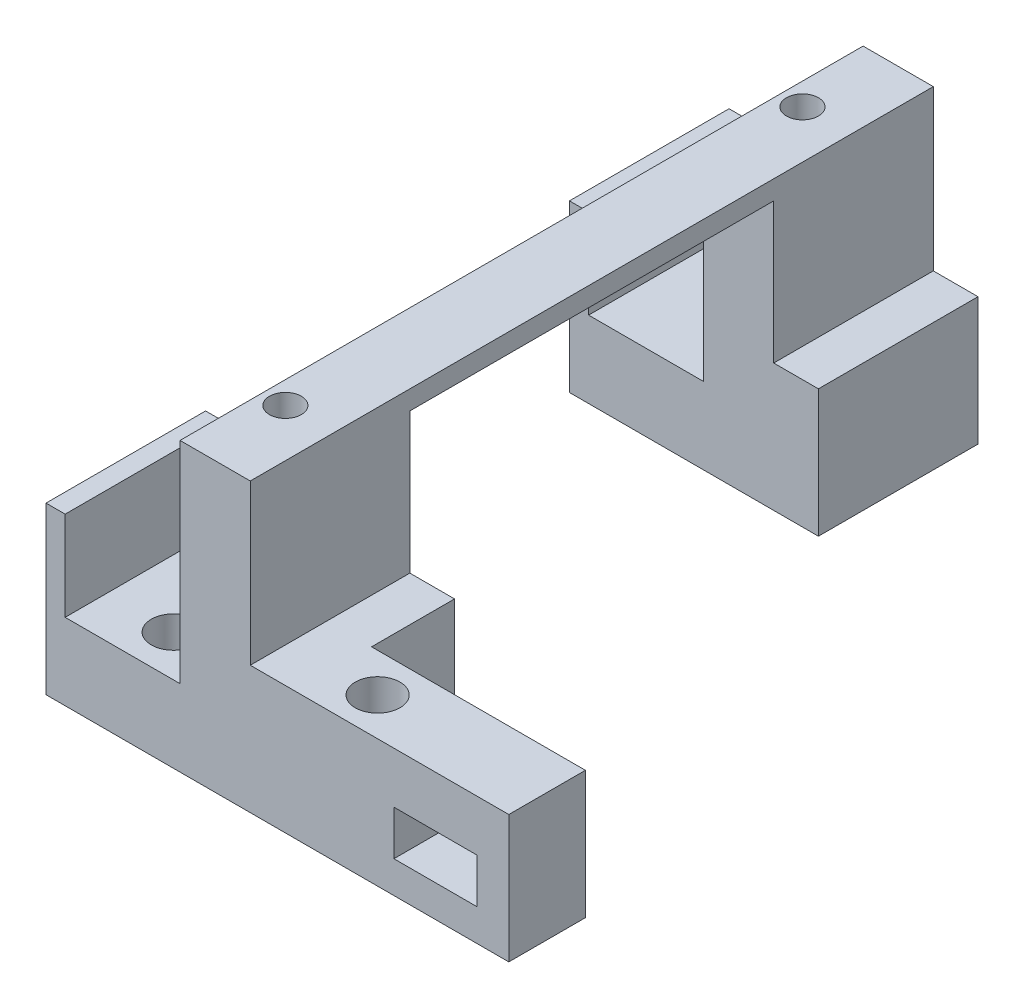
ISO-10303-21;
HEADER;
FILE_DESCRIPTION(('STEP AP214'),'2;1');
FILE_NAME('part.step','',(''),(''),'','','');
FILE_SCHEMA(('AUTOMOTIVE_DESIGN { 1 0 10303 214 1 1 1 1 }'));
ENDSEC;
DATA;
#1=APPLICATION_CONTEXT('core data for automotive mechanical design processes');
#2=APPLICATION_PROTOCOL_DEFINITION('international standard','automotive_design',2000,#1);
#3=PRODUCT_CONTEXT('',#1,'mechanical');
#4=PRODUCT('Part','Part','',(#3));
#5=PRODUCT_RELATED_PRODUCT_CATEGORY('part','',(#4));
#6=PRODUCT_DEFINITION_FORMATION('','',#4);
#7=PRODUCT_DEFINITION_CONTEXT('part definition',#1,'design');
#8=PRODUCT_DEFINITION('design','',#6,#7);
#9=PRODUCT_DEFINITION_SHAPE('','',#8);
#10=(LENGTH_UNIT() NAMED_UNIT(*) SI_UNIT(.MILLI.,.METRE.));
#11=(NAMED_UNIT(*) PLANE_ANGLE_UNIT() SI_UNIT($,.RADIAN.));
#12=(NAMED_UNIT(*) SI_UNIT($,.STERADIAN.) SOLID_ANGLE_UNIT());
#13=UNCERTAINTY_MEASURE_WITH_UNIT(LENGTH_MEASURE(1.E-05),#10,'distance_accuracy_value','');
#14=(GEOMETRIC_REPRESENTATION_CONTEXT(3) GLOBAL_UNCERTAINTY_ASSIGNED_CONTEXT((#13)) GLOBAL_UNIT_ASSIGNED_CONTEXT((#10,
#11,#12)) REPRESENTATION_CONTEXT('',''));
#15=CARTESIAN_POINT('',(0.,0.,0.));
#16=DIRECTION('',(0.,0.,1.));
#17=DIRECTION('',(1.,0.,0.));
#18=AXIS2_PLACEMENT_3D('',#15,#16,#17);
#19=CARTESIAN_POINT('',(39.,0.,107.));
#20=DIRECTION('',(-1.,0.,0.));
#21=DIRECTION('',(0.,0.,1.));
#22=AXIS2_PLACEMENT_3D('',#19,#20,#21);
#23=PLANE('',#22);
#24=DIRECTION('',(0.,1.,0.));
#25=VECTOR('',#24,1.);
#26=CARTESIAN_POINT('',(39.,0.,95.));
#27=LINE('',#26,#25);
#28=CARTESIAN_POINT('',(39.,0.,95.));
#29=VERTEX_POINT('',#28);
#30=CARTESIAN_POINT('',(39.,20.,95.));
#31=VERTEX_POINT('',#30);
#32=EDGE_CURVE('E250',#29,#31,#27,.T.);
#33=ORIENTED_EDGE('',*,*,#32,.F.);
#34=DIRECTION('',(0.,0.,-1.));
#35=VECTOR('',#34,1.);
#36=CARTESIAN_POINT('',(39.,0.,107.));
#37=LINE('',#36,#35);
#38=CARTESIAN_POINT('',(39.,0.,82.));
#39=VERTEX_POINT('',#38);
#40=EDGE_CURVE('E437',#29,#39,#37,.T.);
#41=ORIENTED_EDGE('',*,*,#40,.T.);
#42=DIRECTION('',(0.,-1.,0.));
#43=VECTOR('',#42,1.);
#44=CARTESIAN_POINT('',(39.,42.,82.));
#45=LINE('',#44,#43);
#46=CARTESIAN_POINT('',(39.,20.,82.));
#47=VERTEX_POINT('',#46);
#48=EDGE_CURVE('E309',#47,#39,#45,.T.);
#49=ORIENTED_EDGE('',*,*,#48,.F.);
#50=DIRECTION('',(0.,0.,-1.));
#51=VECTOR('',#50,1.);
#52=CARTESIAN_POINT('',(39.,20.,107.));
#53=LINE('',#52,#51);
#54=EDGE_CURVE('E270',#31,#47,#53,.T.);
#55=ORIENTED_EDGE('',*,*,#54,.F.);
#56=EDGE_LOOP('',(#33,#41,#49,#55));
#57=FACE_BOUND('',#56,.T.);
#58=ADVANCED_FACE('F33',(#57),#23,.F.);
#59=CARTESIAN_POINT('',(0.,26.,107.));
#60=DIRECTION('',(1.,0.,0.));
#61=DIRECTION('',(0.,1.,0.));
#62=AXIS2_PLACEMENT_3D('',#59,#60,#61);
#63=PLANE('',#62);
#64=DIRECTION('',(0.,0.,-1.));
#65=VECTOR('',#64,1.);
#66=CARTESIAN_POINT('',(0.,0.,107.));
#67=LINE('',#66,#65);
#68=CARTESIAN_POINT('',(0.,0.,25.));
#69=VERTEX_POINT('',#68);
#70=CARTESIAN_POINT('',(0.,0.,0.));
#71=VERTEX_POINT('',#70);
#72=EDGE_CURVE('E440',#69,#71,#67,.T.);
#73=ORIENTED_EDGE('',*,*,#72,.F.);
#74=DIRECTION('',(0.,-1.,0.));
#75=VECTOR('',#74,1.);
#76=CARTESIAN_POINT('',(0.,0.,25.));
#77=LINE('',#76,#75);
#78=CARTESIAN_POINT('',(0.,26.,25.));
#79=VERTEX_POINT('',#78);
#80=EDGE_CURVE('E312',#79,#69,#77,.T.);
#81=ORIENTED_EDGE('',*,*,#80,.F.);
#82=DIRECTION('',(0.,0.,-1.));
#83=VECTOR('',#82,1.);
#84=CARTESIAN_POINT('',(0.,26.,107.));
#85=LINE('',#84,#83);
#86=CARTESIAN_POINT('',(0.,26.,0.));
#87=VERTEX_POINT('',#86);
#88=EDGE_CURVE('E380',#79,#87,#85,.T.);
#89=ORIENTED_EDGE('',*,*,#88,.T.);
#90=DIRECTION('',(0.,-1.,0.));
#91=VECTOR('',#90,1.);
#92=CARTESIAN_POINT('',(0.,26.,0.));
#93=LINE('',#92,#91);
#94=EDGE_CURVE('E359',#87,#71,#93,.T.);
#95=ORIENTED_EDGE('',*,*,#94,.T.);
#96=EDGE_LOOP('',(#73,#81,#89,#95));
#97=FACE_BOUND('',#96,.T.);
#98=ADVANCED_FACE('F464',(#97),#63,.F.);
#99=CARTESIAN_POINT('',(0.,0.,107.));
#100=DIRECTION('',(0.,1.,0.));
#101=DIRECTION('',(0.,0.,1.));
#102=AXIS2_PLACEMENT_3D('',#99,#100,#101);
#103=PLANE('',#102);
#104=CARTESIAN_POINT('',(13.5,0.,6.5));
#105=DIRECTION('',(0.,1.,0.));
#106=DIRECTION('',(0.,0.,1.));
#107=AXIS2_PLACEMENT_3D('',#104,#105,#106);
#108=CIRCLE('',#107,3.5);
#109=CARTESIAN_POINT('',(13.5,0.,10.));
#110=VERTEX_POINT('',#109);
#111=EDGE_CURVE('E281',#110,#110,#108,.F.);
#112=ORIENTED_EDGE('',*,*,#111,.F.);
#113=EDGE_LOOP('',(#112));
#114=FACE_BOUND('',#113,.T.);
#115=CARTESIAN_POINT('',(24.5,0.,13.));
#116=DIRECTION('',(0.,1.,0.));
#117=DIRECTION('',(0.,0.,1.));
#118=AXIS2_PLACEMENT_3D('',#115,#116,#117);
#119=CIRCLE('',#118,2.5);
#120=CARTESIAN_POINT('',(24.5,0.,15.5));
#121=VERTEX_POINT('',#120);
#122=EDGE_CURVE('E297',#121,#121,#119,.F.);
#123=ORIENTED_EDGE('',*,*,#122,.F.);
#124=EDGE_LOOP('',(#123));
#125=FACE_BOUND('',#124,.T.);
#126=CARTESIAN_POINT('',(39.,0.,25.));
#127=VERTEX_POINT('',#126);
#128=CARTESIAN_POINT('',(39.,0.,0.));
#129=VERTEX_POINT('',#128);
#130=EDGE_CURVE('E434',#127,#129,#37,.T.);
#131=ORIENTED_EDGE('',*,*,#130,.F.);
#132=DIRECTION('',(-1.,0.,0.));
#133=VECTOR('',#132,1.);
#134=CARTESIAN_POINT('',(109.802542327236,0.,25.));
#135=LINE('',#134,#133);
#136=EDGE_CURVE('E310',#127,#69,#135,.T.);
#137=ORIENTED_EDGE('',*,*,#136,.T.);
#138=ORIENTED_EDGE('',*,*,#72,.T.);
#139=DIRECTION('',(1.,0.,0.));
#140=VECTOR('',#139,1.);
#141=CARTESIAN_POINT('',(0.,0.,0.));
#142=LINE('',#141,#140);
#143=EDGE_CURVE('E383',#71,#129,#142,.T.);
#144=ORIENTED_EDGE('',*,*,#143,.T.);
#145=EDGE_LOOP('',(#131,#137,#138,#144));
#146=FACE_BOUND('',#145,.T.);
#147=ADVANCED_FACE('F455',(#114,#125,#146),#103,.F.);
#148=CARTESIAN_POINT('',(39.,20.,25.));
#149=VERTEX_POINT('',#148);
#150=CARTESIAN_POINT('',(39.,20.,0.));
#151=VERTEX_POINT('',#150);
#152=EDGE_CURVE('E431',#149,#151,#53,.T.);
#153=ORIENTED_EDGE('',*,*,#152,.F.);
#154=DIRECTION('',(0.,1.,0.));
#155=VECTOR('',#154,1.);
#156=CARTESIAN_POINT('',(39.,0.,25.));
#157=LINE('',#156,#155);
#158=EDGE_CURVE('E307',#127,#149,#157,.T.);
#159=ORIENTED_EDGE('',*,*,#158,.F.);
#160=ORIENTED_EDGE('',*,*,#130,.T.);
#161=DIRECTION('',(0.,1.,0.));
#162=VECTOR('',#161,1.);
#163=CARTESIAN_POINT('',(39.,0.,0.));
#164=LINE('',#163,#162);
#165=EDGE_CURVE('E386',#129,#151,#164,.T.);
#166=ORIENTED_EDGE('',*,*,#165,.T.);
#167=EDGE_LOOP('',(#153,#159,#160,#166));
#168=FACE_BOUND('',#167,.T.);
#169=ADVANCED_FACE('F497',(#168),#23,.F.);
#170=CARTESIAN_POINT('',(39.,20.,107.));
#171=DIRECTION('',(0.,-1.,0.));
#172=DIRECTION('',(0.,0.,-1.));
#173=AXIS2_PLACEMENT_3D('',#170,#171,#172);
#174=PLANE('',#173);
#175=DIRECTION('',(0.,0.,-1.));
#176=VECTOR('',#175,1.);
#177=CARTESIAN_POINT('',(32.,20.,107.));
#178=LINE('',#177,#176);
#179=CARTESIAN_POINT('',(32.,20.,25.));
#180=VERTEX_POINT('',#179);
#181=CARTESIAN_POINT('',(32.,20.,0.));
#182=VERTEX_POINT('',#181);
#183=EDGE_CURVE('E428',#180,#182,#178,.T.);
#184=ORIENTED_EDGE('',*,*,#183,.F.);
#185=DIRECTION('',(1.,0.,0.));
#186=VECTOR('',#185,1.);
#187=CARTESIAN_POINT('',(39.,20.,25.));
#188=LINE('',#187,#186);
#189=EDGE_CURVE('E353',#180,#149,#188,.T.);
#190=ORIENTED_EDGE('',*,*,#189,.T.);
#191=ORIENTED_EDGE('',*,*,#152,.T.);
#192=DIRECTION('',(-1.,0.,0.));
#193=VECTOR('',#192,1.);
#194=CARTESIAN_POINT('',(39.,20.,0.));
#195=LINE('',#194,#193);
#196=EDGE_CURVE('E389',#151,#182,#195,.T.);
#197=ORIENTED_EDGE('',*,*,#196,.T.);
#198=EDGE_LOOP('',(#184,#190,#191,#197));
#199=FACE_BOUND('',#198,.T.);
#200=ADVANCED_FACE('F493',(#199),#174,.F.);
#201=CARTESIAN_POINT('',(21.,12.,107.));
#202=DIRECTION('',(0.,-1.,0.));
#203=DIRECTION('',(1.,0.,0.));
#204=AXIS2_PLACEMENT_3D('',#201,#202,#203);
#205=PLANE('',#204);
#206=CARTESIAN_POINT('',(13.5,12.,6.5));
#207=DIRECTION('',(0.,1.,0.));
#208=DIRECTION('',(-1.,0.,0.));
#209=AXIS2_PLACEMENT_3D('',#206,#207,#208);
#210=CIRCLE('',#209,3.5);
#211=CARTESIAN_POINT('',(9.99999999999999,12.,6.5));
#212=VERTEX_POINT('',#211);
#213=EDGE_CURVE('E264',#212,#212,#210,.T.);
#214=ORIENTED_EDGE('',*,*,#213,.F.);
#215=EDGE_LOOP('',(#214));
#216=FACE_BOUND('',#215,.T.);
#217=DIRECTION('',(0.,0.,-1.));
#218=VECTOR('',#217,1.);
#219=CARTESIAN_POINT('',(3.,12.,107.));
#220=LINE('',#219,#218);
#221=CARTESIAN_POINT('',(3.,12.,25.));
#222=VERTEX_POINT('',#221);
#223=CARTESIAN_POINT('',(3.,12.,0.));
#224=VERTEX_POINT('',#223);
#225=EDGE_CURVE('E414',#222,#224,#220,.T.);
#226=ORIENTED_EDGE('',*,*,#225,.F.);
#227=DIRECTION('',(1.,0.,0.));
#228=VECTOR('',#227,1.);
#229=CARTESIAN_POINT('',(21.,12.,25.));
#230=LINE('',#229,#228);
#231=CARTESIAN_POINT('',(21.,12.,25.));
#232=VERTEX_POINT('',#231);
#233=EDGE_CURVE('E344',#222,#232,#230,.T.);
#234=ORIENTED_EDGE('',*,*,#233,.T.);
#235=DIRECTION('',(0.,0.,-1.));
#236=VECTOR('',#235,1.);
#237=CARTESIAN_POINT('',(21.,12.,107.));
#238=LINE('',#237,#236);
#239=CARTESIAN_POINT('',(21.,12.,0.));
#240=VERTEX_POINT('',#239);
#241=EDGE_CURVE('E418',#232,#240,#238,.T.);
#242=ORIENTED_EDGE('',*,*,#241,.T.);
#243=DIRECTION('',(-1.,0.,0.));
#244=VECTOR('',#243,1.);
#245=CARTESIAN_POINT('',(21.,12.,0.));
#246=LINE('',#245,#244);
#247=EDGE_CURVE('E399',#240,#224,#246,.T.);
#248=ORIENTED_EDGE('',*,*,#247,.T.);
#249=EDGE_LOOP('',(#226,#234,#242,#248));
#250=FACE_BOUND('',#249,.T.);
#251=ADVANCED_FACE('F476',(#216,#250),#205,.F.);
#252=CARTESIAN_POINT('',(3.,12.,107.));
#253=DIRECTION('',(-1.,0.,0.));
#254=DIRECTION('',(0.,-1.,0.));
#255=AXIS2_PLACEMENT_3D('',#252,#253,#254);
#256=PLANE('',#255);
#257=DIRECTION('',(0.,0.,-1.));
#258=VECTOR('',#257,1.);
#259=CARTESIAN_POINT('',(3.,26.,107.));
#260=LINE('',#259,#258);
#261=CARTESIAN_POINT('',(3.,26.,25.));
#262=VERTEX_POINT('',#261);
#263=CARTESIAN_POINT('',(3.,26.,0.));
#264=VERTEX_POINT('',#263);
#265=EDGE_CURVE('E410',#262,#264,#260,.T.);
#266=ORIENTED_EDGE('',*,*,#265,.F.);
#267=DIRECTION('',(0.,-1.,0.));
#268=VECTOR('',#267,1.);
#269=CARTESIAN_POINT('',(3.,12.,25.));
#270=LINE('',#269,#268);
#271=EDGE_CURVE('E341',#262,#222,#270,.T.);
#272=ORIENTED_EDGE('',*,*,#271,.T.);
#273=ORIENTED_EDGE('',*,*,#225,.T.);
#274=DIRECTION('',(0.,1.,0.));
#275=VECTOR('',#274,1.);
#276=CARTESIAN_POINT('',(3.,12.,0.));
#277=LINE('',#276,#275);
#278=EDGE_CURVE('E402',#224,#264,#277,.T.);
#279=ORIENTED_EDGE('',*,*,#278,.T.);
#280=EDGE_LOOP('',(#266,#272,#273,#279));
#281=FACE_BOUND('',#280,.T.);
#282=ADVANCED_FACE('F473',(#281),#256,.F.);
#283=CARTESIAN_POINT('',(3.,26.,107.));
#284=DIRECTION('',(0.,-1.,0.));
#285=DIRECTION('',(0.,0.,-1.));
#286=AXIS2_PLACEMENT_3D('',#283,#284,#285);
#287=PLANE('',#286);
#288=ORIENTED_EDGE('',*,*,#88,.F.);
#289=DIRECTION('',(1.,0.,0.));
#290=VECTOR('',#289,1.);
#291=CARTESIAN_POINT('',(3.,26.,25.));
#292=LINE('',#291,#290);
#293=EDGE_CURVE('E42',#79,#262,#292,.T.);
#294=ORIENTED_EDGE('',*,*,#293,.T.);
#295=ORIENTED_EDGE('',*,*,#265,.T.);
#296=DIRECTION('',(-1.,0.,0.));
#297=VECTOR('',#296,1.);
#298=CARTESIAN_POINT('',(3.,26.,0.));
#299=LINE('',#298,#297);
#300=EDGE_CURVE('E364',#264,#87,#299,.T.);
#301=ORIENTED_EDGE('',*,*,#300,.T.);
#302=EDGE_LOOP('',(#288,#294,#295,#301));
#303=FACE_BOUND('',#302,.T.);
#304=ADVANCED_FACE('F467',(#303),#287,.F.);
#305=CARTESIAN_POINT('',(0.,26.,107.));
#306=VERTEX_POINT('',#305);
#307=CARTESIAN_POINT('',(0.,26.,82.));
#308=VERTEX_POINT('',#307);
#309=EDGE_CURVE('E407',#306,#308,#85,.T.);
#310=ORIENTED_EDGE('',*,*,#309,.T.);
#311=DIRECTION('',(0.,1.,0.));
#312=VECTOR('',#311,1.);
#313=CARTESIAN_POINT('',(0.,42.,82.));
#314=LINE('',#313,#312);
#315=CARTESIAN_POINT('',(0.,0.,82.));
#316=VERTEX_POINT('',#315);
#317=EDGE_CURVE('E306',#316,#308,#314,.T.);
#318=ORIENTED_EDGE('',*,*,#317,.F.);
#319=CARTESIAN_POINT('',(0.,0.,107.));
#320=VERTEX_POINT('',#319);
#321=EDGE_CURVE('E438',#320,#316,#67,.T.);
#322=ORIENTED_EDGE('',*,*,#321,.F.);
#323=DIRECTION('',(0.,-1.,0.));
#324=VECTOR('',#323,1.);
#325=CARTESIAN_POINT('',(0.,26.,107.));
#326=LINE('',#325,#324);
#327=EDGE_CURVE('E360',#306,#320,#326,.T.);
#328=ORIENTED_EDGE('',*,*,#327,.F.);
#329=EDGE_LOOP('',(#310,#318,#322,#328));
#330=FACE_BOUND('',#329,.T.);
#331=ADVANCED_FACE('F35',(#330),#63,.F.);
#332=CARTESIAN_POINT('',(46.,0.,101.053923335826));
#333=DIRECTION('',(0.,1.,0.));
#334=DIRECTION('',(0.,0.,1.));
#335=AXIS2_PLACEMENT_3D('',#332,#333,#334);
#336=CIRCLE('',#335,3.5);
#337=CARTESIAN_POINT('',(46.,0.,104.553923335826));
#338=VERTEX_POINT('',#337);
#339=EDGE_CURVE('E247',#338,#338,#336,.F.);
#340=ORIENTED_EDGE('',*,*,#339,.F.);
#341=EDGE_LOOP('',(#340));
#342=FACE_BOUND('',#341,.T.);
#343=CARTESIAN_POINT('',(13.5,0.,100.5));
#344=DIRECTION('',(0.,1.,0.));
#345=DIRECTION('',(0.,0.,1.));
#346=AXIS2_PLACEMENT_3D('',#343,#344,#345);
#347=CIRCLE('',#346,3.5);
#348=CARTESIAN_POINT('',(13.5,0.,104.));
#349=VERTEX_POINT('',#348);
#350=EDGE_CURVE('E289',#349,#349,#347,.F.);
#351=ORIENTED_EDGE('',*,*,#350,.F.);
#352=EDGE_LOOP('',(#351));
#353=FACE_BOUND('',#352,.T.);
#354=CARTESIAN_POINT('',(24.5,0.,94.));
#355=DIRECTION('',(0.,1.,0.));
#356=DIRECTION('',(0.,0.,1.));
#357=AXIS2_PLACEMENT_3D('',#354,#355,#356);
#358=CIRCLE('',#357,2.5);
#359=CARTESIAN_POINT('',(24.5,0.,96.5));
#360=VERTEX_POINT('',#359);
#361=EDGE_CURVE('E303',#360,#360,#358,.F.);
#362=ORIENTED_EDGE('',*,*,#361,.F.);
#363=EDGE_LOOP('',(#362));
#364=FACE_BOUND('',#363,.T.);
#365=ORIENTED_EDGE('',*,*,#321,.T.);
#366=DIRECTION('',(-1.,0.,0.));
#367=VECTOR('',#366,1.);
#368=CARTESIAN_POINT('',(109.802542327236,0.,82.));
#369=LINE('',#368,#367);
#370=EDGE_CURVE('E314',#39,#316,#369,.T.);
#371=ORIENTED_EDGE('',*,*,#370,.F.);
#372=ORIENTED_EDGE('',*,*,#40,.F.);
#373=DIRECTION('',(-1.,0.,0.));
#374=VECTOR('',#373,1.);
#375=CARTESIAN_POINT('',(72.5,0.,95.));
#376=LINE('',#375,#374);
#377=CARTESIAN_POINT('',(72.5,0.,95.));
#378=VERTEX_POINT('',#377);
#379=EDGE_CURVE('E275',#378,#29,#376,.T.);
#380=ORIENTED_EDGE('',*,*,#379,.F.);
#381=DIRECTION('',(0.,0.,-1.));
#382=VECTOR('',#381,1.);
#383=CARTESIAN_POINT('',(72.5,0.,107.));
#384=LINE('',#383,#382);
#385=CARTESIAN_POINT('',(72.5,0.,107.));
#386=VERTEX_POINT('',#385);
#387=EDGE_CURVE('E254',#386,#378,#384,.T.);
#388=ORIENTED_EDGE('',*,*,#387,.F.);
#389=DIRECTION('',(1.,0.,0.));
#390=VECTOR('',#389,1.);
#391=CARTESIAN_POINT('',(0.,0.,107.));
#392=LINE('',#391,#390);
#393=EDGE_CURVE('E363',#320,#386,#392,.T.);
#394=ORIENTED_EDGE('',*,*,#393,.F.);
#395=EDGE_LOOP('',(#365,#371,#372,#380,#388,#394));
#396=FACE_BOUND('',#395,.T.);
#397=ADVANCED_FACE('F515',(#342,#353,#364,#396),#103,.F.);
#398=CARTESIAN_POINT('',(46.,20.,101.053923335826));
#399=DIRECTION('',(0.,1.,0.));
#400=DIRECTION('',(0.,0.,1.));
#401=AXIS2_PLACEMENT_3D('',#398,#399,#400);
#402=CIRCLE('',#401,3.5);
#403=CARTESIAN_POINT('',(46.,20.,104.553923335826));
#404=VERTEX_POINT('',#403);
#405=EDGE_CURVE('E222',#404,#404,#402,.T.);
#406=ORIENTED_EDGE('',*,*,#405,.F.);
#407=EDGE_LOOP('',(#406));
#408=FACE_BOUND('',#407,.T.);
#409=DIRECTION('',(-1.,0.,0.));
#410=VECTOR('',#409,1.);
#411=CARTESIAN_POINT('',(39.,20.,107.));
#412=LINE('',#411,#410);
#413=CARTESIAN_POINT('',(72.5,20.,107.));
#414=VERTEX_POINT('',#413);
#415=CARTESIAN_POINT('',(32.,20.,107.));
#416=VERTEX_POINT('',#415);
#417=EDGE_CURVE('E366',#414,#416,#412,.T.);
#418=ORIENTED_EDGE('',*,*,#417,.F.);
#419=DIRECTION('',(0.,0.,1.));
#420=VECTOR('',#419,1.);
#421=CARTESIAN_POINT('',(72.5,20.,95.));
#422=LINE('',#421,#420);
#423=CARTESIAN_POINT('',(72.5,20.,95.));
#424=VERTEX_POINT('',#423);
#425=EDGE_CURVE('E258',#424,#414,#422,.T.);
#426=ORIENTED_EDGE('',*,*,#425,.F.);
#427=DIRECTION('',(-1.,0.,0.));
#428=VECTOR('',#427,1.);
#429=CARTESIAN_POINT('',(72.5,20.,95.));
#430=LINE('',#429,#428);
#431=EDGE_CURVE('E261',#424,#31,#430,.T.);
#432=ORIENTED_EDGE('',*,*,#431,.T.);
#433=ORIENTED_EDGE('',*,*,#54,.T.);
#434=DIRECTION('',(-1.,0.,0.));
#435=VECTOR('',#434,1.);
#436=CARTESIAN_POINT('',(39.,20.,82.));
#437=LINE('',#436,#435);
#438=CARTESIAN_POINT('',(32.,20.,82.));
#439=VERTEX_POINT('',#438);
#440=EDGE_CURVE('E338',#47,#439,#437,.T.);
#441=ORIENTED_EDGE('',*,*,#440,.T.);
#442=EDGE_CURVE('E429',#416,#439,#178,.T.);
#443=ORIENTED_EDGE('',*,*,#442,.F.);
#444=EDGE_LOOP('',(#418,#426,#432,#433,#441,#443));
#445=FACE_BOUND('',#444,.T.);
#446=ADVANCED_FACE('F510',(#408,#445),#174,.F.);
#447=CARTESIAN_POINT('',(32.,20.,107.));
#448=DIRECTION('',(-1.,0.,0.));
#449=DIRECTION('',(0.,0.,1.));
#450=AXIS2_PLACEMENT_3D('',#447,#448,#449);
#451=PLANE('',#450);
#452=DIRECTION('',(0.,0.,-1.));
#453=VECTOR('',#452,1.);
#454=CARTESIAN_POINT('',(32.,42.,107.));
#455=LINE('',#454,#453);
#456=CARTESIAN_POINT('',(32.,42.,82.));
#457=VERTEX_POINT('',#456);
#458=CARTESIAN_POINT('',(32.,42.,25.));
#459=VERTEX_POINT('',#458);
#460=EDGE_CURVE('E356',#457,#459,#455,.T.);
#461=ORIENTED_EDGE('',*,*,#460,.T.);
#462=DIRECTION('',(0.,-1.,0.));
#463=VECTOR('',#462,1.);
#464=CARTESIAN_POINT('',(32.,20.,25.));
#465=LINE('',#464,#463);
#466=EDGE_CURVE('E350',#459,#180,#465,.T.);
#467=ORIENTED_EDGE('',*,*,#466,.T.);
#468=ORIENTED_EDGE('',*,*,#183,.T.);
#469=DIRECTION('',(0.,1.,0.));
#470=VECTOR('',#469,1.);
#471=CARTESIAN_POINT('',(32.,20.,0.));
#472=LINE('',#471,#470);
#473=CARTESIAN_POINT('',(32.,45.,0.));
#474=VERTEX_POINT('',#473);
#475=EDGE_CURVE('E392',#182,#474,#472,.T.);
#476=ORIENTED_EDGE('',*,*,#475,.T.);
#477=DIRECTION('',(0.,0.,-1.));
#478=VECTOR('',#477,1.);
#479=CARTESIAN_POINT('',(32.,45.,107.));
#480=LINE('',#479,#478);
#481=CARTESIAN_POINT('',(32.,45.,107.));
#482=VERTEX_POINT('',#481);
#483=EDGE_CURVE('E425',#482,#474,#480,.T.);
#484=ORIENTED_EDGE('',*,*,#483,.F.);
#485=DIRECTION('',(0.,1.,0.));
#486=VECTOR('',#485,1.);
#487=CARTESIAN_POINT('',(32.,20.,107.));
#488=LINE('',#487,#486);
#489=EDGE_CURVE('E368',#416,#482,#488,.T.);
#490=ORIENTED_EDGE('',*,*,#489,.F.);
#491=ORIENTED_EDGE('',*,*,#442,.T.);
#492=DIRECTION('',(0.,1.,0.));
#493=VECTOR('',#492,1.);
#494=CARTESIAN_POINT('',(32.,20.,82.));
#495=LINE('',#494,#493);
#496=EDGE_CURVE('E335',#439,#457,#495,.T.);
#497=ORIENTED_EDGE('',*,*,#496,.T.);
#498=EDGE_LOOP('',(#461,#467,#468,#476,#484,#490,#491,#497));
#499=FACE_BOUND('',#498,.T.);
#500=ADVANCED_FACE('F490',(#499),#451,.F.);
#501=CARTESIAN_POINT('',(32.,45.,107.));
#502=DIRECTION('',(0.,-1.,0.));
#503=DIRECTION('',(1.,0.,0.));
#504=AXIS2_PLACEMENT_3D('',#501,#502,#503);
#505=PLANE('',#504);
#506=CARTESIAN_POINT('',(24.5,45.,13.));
#507=DIRECTION('',(0.,1.,0.));
#508=DIRECTION('',(0.,0.,1.));
#509=AXIS2_PLACEMENT_3D('',#506,#507,#508);
#510=CIRCLE('',#509,2.5);
#511=CARTESIAN_POINT('',(24.5,45.,15.5));
#512=VERTEX_POINT('',#511);
#513=EDGE_CURVE('E294',#512,#512,#510,.T.);
#514=ORIENTED_EDGE('',*,*,#513,.F.);
#515=EDGE_LOOP('',(#514));
#516=FACE_BOUND('',#515,.T.);
#517=CARTESIAN_POINT('',(24.5,45.,94.));
#518=DIRECTION('',(0.,1.,0.));
#519=DIRECTION('',(0.,0.,1.));
#520=AXIS2_PLACEMENT_3D('',#517,#518,#519);
#521=CIRCLE('',#520,2.5);
#522=CARTESIAN_POINT('',(24.5,45.,96.5));
#523=VERTEX_POINT('',#522);
#524=EDGE_CURVE('E300',#523,#523,#521,.T.);
#525=ORIENTED_EDGE('',*,*,#524,.F.);
#526=EDGE_LOOP('',(#525));
#527=FACE_BOUND('',#526,.T.);
#528=DIRECTION('',(-1.,0.,0.));
#529=VECTOR('',#528,1.);
#530=CARTESIAN_POINT('',(32.,45.,0.));
#531=LINE('',#530,#529);
#532=CARTESIAN_POINT('',(21.,45.,0.));
#533=VERTEX_POINT('',#532);
#534=EDGE_CURVE('E394',#474,#533,#531,.T.);
#535=ORIENTED_EDGE('',*,*,#534,.T.);
#536=DIRECTION('',(0.,0.,-1.));
#537=VECTOR('',#536,1.);
#538=CARTESIAN_POINT('',(21.,45.,107.));
#539=LINE('',#538,#537);
#540=CARTESIAN_POINT('',(21.,45.,107.));
#541=VERTEX_POINT('',#540);
#542=EDGE_CURVE('E422',#541,#533,#539,.T.);
#543=ORIENTED_EDGE('',*,*,#542,.F.);
#544=DIRECTION('',(-1.,0.,0.));
#545=VECTOR('',#544,1.);
#546=CARTESIAN_POINT('',(32.,45.,107.));
#547=LINE('',#546,#545);
#548=EDGE_CURVE('E370',#482,#541,#547,.T.);
#549=ORIENTED_EDGE('',*,*,#548,.F.);
#550=ORIENTED_EDGE('',*,*,#483,.T.);
#551=EDGE_LOOP('',(#535,#543,#549,#550));
#552=FACE_BOUND('',#551,.T.);
#553=ADVANCED_FACE('F485',(#516,#527,#552),#505,.F.);
#554=CARTESIAN_POINT('',(21.,45.,107.));
#555=DIRECTION('',(1.,0.,0.));
#556=DIRECTION('',(0.,1.,0.));
#557=AXIS2_PLACEMENT_3D('',#554,#555,#556);
#558=PLANE('',#557);
#559=ORIENTED_EDGE('',*,*,#241,.F.);
#560=DIRECTION('',(0.,1.,0.));
#561=VECTOR('',#560,1.);
#562=CARTESIAN_POINT('',(21.,45.,25.));
#563=LINE('',#562,#561);
#564=CARTESIAN_POINT('',(21.,42.,25.));
#565=VERTEX_POINT('',#564);
#566=EDGE_CURVE('E347',#232,#565,#563,.T.);
#567=ORIENTED_EDGE('',*,*,#566,.T.);
#568=DIRECTION('',(0.,0.,1.));
#569=VECTOR('',#568,1.);
#570=CARTESIAN_POINT('',(21.,42.,107.));
#571=LINE('',#570,#569);
#572=CARTESIAN_POINT('',(21.,42.,82.));
#573=VERTEX_POINT('',#572);
#574=EDGE_CURVE('E11',#565,#573,#571,.T.);
#575=ORIENTED_EDGE('',*,*,#574,.T.);
#576=DIRECTION('',(0.,-1.,0.));
#577=VECTOR('',#576,1.);
#578=CARTESIAN_POINT('',(21.,45.,82.));
#579=LINE('',#578,#577);
#580=CARTESIAN_POINT('',(21.,12.,82.));
#581=VERTEX_POINT('',#580);
#582=EDGE_CURVE('E332',#573,#581,#579,.T.);
#583=ORIENTED_EDGE('',*,*,#582,.T.);
#584=CARTESIAN_POINT('',(21.,12.,107.));
#585=VERTEX_POINT('',#584);
#586=EDGE_CURVE('E419',#585,#581,#238,.T.);
#587=ORIENTED_EDGE('',*,*,#586,.F.);
#588=DIRECTION('',(0.,-1.,0.));
#589=VECTOR('',#588,1.);
#590=CARTESIAN_POINT('',(21.,45.,107.));
#591=LINE('',#590,#589);
#592=EDGE_CURVE('E372',#541,#585,#591,.T.);
#593=ORIENTED_EDGE('',*,*,#592,.F.);
#594=ORIENTED_EDGE('',*,*,#542,.T.);
#595=DIRECTION('',(0.,-1.,0.));
#596=VECTOR('',#595,1.);
#597=CARTESIAN_POINT('',(21.,45.,0.));
#598=LINE('',#597,#596);
#599=EDGE_CURVE('E396',#533,#240,#598,.T.);
#600=ORIENTED_EDGE('',*,*,#599,.T.);
#601=EDGE_LOOP('',(#559,#567,#575,#583,#587,#593,#594,#600));
#602=FACE_BOUND('',#601,.T.);
#603=ADVANCED_FACE('F479',(#602),#558,.F.);
#604=CARTESIAN_POINT('',(13.5,12.,100.5));
#605=DIRECTION('',(0.,1.,0.));
#606=DIRECTION('',(-1.,0.,0.));
#607=AXIS2_PLACEMENT_3D('',#604,#605,#606);
#608=CIRCLE('',#607,3.5);
#609=CARTESIAN_POINT('',(9.99999999999999,12.,100.5));
#610=VERTEX_POINT('',#609);
#611=EDGE_CURVE('E285',#610,#610,#608,.T.);
#612=ORIENTED_EDGE('',*,*,#611,.F.);
#613=EDGE_LOOP('',(#612));
#614=FACE_BOUND('',#613,.T.);
#615=ORIENTED_EDGE('',*,*,#586,.T.);
#616=DIRECTION('',(-1.,0.,0.));
#617=VECTOR('',#616,1.);
#618=CARTESIAN_POINT('',(21.,12.,82.));
#619=LINE('',#618,#617);
#620=CARTESIAN_POINT('',(3.,12.,82.));
#621=VERTEX_POINT('',#620);
#622=EDGE_CURVE('E329',#581,#621,#619,.T.);
#623=ORIENTED_EDGE('',*,*,#622,.T.);
#624=CARTESIAN_POINT('',(3.,12.,107.));
#625=VERTEX_POINT('',#624);
#626=EDGE_CURVE('E415',#625,#621,#220,.T.);
#627=ORIENTED_EDGE('',*,*,#626,.F.);
#628=DIRECTION('',(-1.,0.,0.));
#629=VECTOR('',#628,1.);
#630=CARTESIAN_POINT('',(21.,12.,107.));
#631=LINE('',#630,#629);
#632=EDGE_CURVE('E374',#585,#625,#631,.T.);
#633=ORIENTED_EDGE('',*,*,#632,.F.);
#634=EDGE_LOOP('',(#615,#623,#627,#633));
#635=FACE_BOUND('',#634,.T.);
#636=ADVANCED_FACE('F531',(#614,#635),#205,.F.);
#637=ORIENTED_EDGE('',*,*,#626,.T.);
#638=DIRECTION('',(0.,1.,0.));
#639=VECTOR('',#638,1.);
#640=CARTESIAN_POINT('',(3.,12.,82.));
#641=LINE('',#640,#639);
#642=CARTESIAN_POINT('',(3.,26.,82.));
#643=VERTEX_POINT('',#642);
#644=EDGE_CURVE('E326',#621,#643,#641,.T.);
#645=ORIENTED_EDGE('',*,*,#644,.T.);
#646=CARTESIAN_POINT('',(3.,26.,107.));
#647=VERTEX_POINT('',#646);
#648=EDGE_CURVE('E411',#647,#643,#260,.T.);
#649=ORIENTED_EDGE('',*,*,#648,.F.);
#650=DIRECTION('',(0.,1.,0.));
#651=VECTOR('',#650,1.);
#652=CARTESIAN_POINT('',(3.,12.,107.));
#653=LINE('',#652,#651);
#654=EDGE_CURVE('E376',#625,#647,#653,.T.);
#655=ORIENTED_EDGE('',*,*,#654,.F.);
#656=EDGE_LOOP('',(#637,#645,#649,#655));
#657=FACE_BOUND('',#656,.T.);
#658=ADVANCED_FACE('F529',(#657),#256,.F.);
#659=ORIENTED_EDGE('',*,*,#648,.T.);
#660=DIRECTION('',(-1.,0.,0.));
#661=VECTOR('',#660,1.);
#662=CARTESIAN_POINT('',(3.,26.,82.));
#663=LINE('',#662,#661);
#664=EDGE_CURVE('E443',#643,#308,#663,.T.);
#665=ORIENTED_EDGE('',*,*,#664,.T.);
#666=ORIENTED_EDGE('',*,*,#309,.F.);
#667=DIRECTION('',(-1.,0.,0.));
#668=VECTOR('',#667,1.);
#669=CARTESIAN_POINT('',(3.,26.,107.));
#670=LINE('',#669,#668);
#671=EDGE_CURVE('E378',#647,#306,#670,.T.);
#672=ORIENTED_EDGE('',*,*,#671,.F.);
#673=EDGE_LOOP('',(#659,#665,#666,#672));
#674=FACE_BOUND('',#673,.T.);
#675=ADVANCED_FACE('F521',(#674),#287,.F.);
#676=CARTESIAN_POINT('',(0.,0.,107.));
#677=DIRECTION('',(0.,0.,1.));
#678=DIRECTION('',(1.,0.,0.));
#679=AXIS2_PLACEMENT_3D('',#676,#677,#678);
#680=PLANE('',#679);
#681=DIRECTION('',(0.,-1.,0.));
#682=VECTOR('',#681,1.);
#683=CARTESIAN_POINT('',(54.5,12.,107.));
#684=LINE('',#683,#682);
#685=CARTESIAN_POINT('',(54.5,12.,107.));
#686=VERTEX_POINT('',#685);
#687=CARTESIAN_POINT('',(54.5,5.,107.));
#688=VERTEX_POINT('',#687);
#689=EDGE_CURVE('E50',#686,#688,#684,.T.);
#690=ORIENTED_EDGE('',*,*,#689,.F.);
#691=DIRECTION('',(-1.,0.,0.));
#692=VECTOR('',#691,1.);
#693=CARTESIAN_POINT('',(54.5,12.,107.));
#694=LINE('',#693,#692);
#695=CARTESIAN_POINT('',(67.5,12.,107.));
#696=VERTEX_POINT('',#695);
#697=EDGE_CURVE('E216',#696,#686,#694,.T.);
#698=ORIENTED_EDGE('',*,*,#697,.F.);
#699=DIRECTION('',(0.,1.,0.));
#700=VECTOR('',#699,1.);
#701=CARTESIAN_POINT('',(67.5,12.,107.));
#702=LINE('',#701,#700);
#703=CARTESIAN_POINT('',(67.5,5.,107.));
#704=VERTEX_POINT('',#703);
#705=EDGE_CURVE('E236',#704,#696,#702,.T.);
#706=ORIENTED_EDGE('',*,*,#705,.F.);
#707=DIRECTION('',(1.,0.,0.));
#708=VECTOR('',#707,1.);
#709=CARTESIAN_POINT('',(54.5,5.,107.));
#710=LINE('',#709,#708);
#711=EDGE_CURVE('E230',#688,#704,#710,.T.);
#712=ORIENTED_EDGE('',*,*,#711,.F.);
#713=EDGE_LOOP('',(#690,#698,#706,#712));
#714=FACE_BOUND('',#713,.T.);
#715=ORIENTED_EDGE('',*,*,#327,.T.);
#716=ORIENTED_EDGE('',*,*,#393,.T.);
#717=DIRECTION('',(0.,-1.,0.));
#718=VECTOR('',#717,1.);
#719=CARTESIAN_POINT('',(72.5,20.,107.));
#720=LINE('',#719,#718);
#721=EDGE_CURVE('E251',#414,#386,#720,.T.);
#722=ORIENTED_EDGE('',*,*,#721,.F.);
#723=ORIENTED_EDGE('',*,*,#417,.T.);
#724=ORIENTED_EDGE('',*,*,#489,.T.);
#725=ORIENTED_EDGE('',*,*,#548,.T.);
#726=ORIENTED_EDGE('',*,*,#592,.T.);
#727=ORIENTED_EDGE('',*,*,#632,.T.);
#728=ORIENTED_EDGE('',*,*,#654,.T.);
#729=ORIENTED_EDGE('',*,*,#671,.T.);
#730=EDGE_LOOP('',(#715,#716,#722,#723,#724,#725,#726,#727,#728,#729));
#731=FACE_BOUND('',#730,.T.);
#732=ADVANCED_FACE('F524',(#714,#731),#680,.T.);
#733=CARTESIAN_POINT('',(0.,0.,0.));
#734=DIRECTION('',(0.,0.,1.));
#735=DIRECTION('',(1.,0.,0.));
#736=AXIS2_PLACEMENT_3D('',#733,#734,#735);
#737=PLANE('',#736);
#738=ORIENTED_EDGE('',*,*,#94,.F.);
#739=ORIENTED_EDGE('',*,*,#300,.F.);
#740=ORIENTED_EDGE('',*,*,#278,.F.);
#741=ORIENTED_EDGE('',*,*,#247,.F.);
#742=ORIENTED_EDGE('',*,*,#599,.F.);
#743=ORIENTED_EDGE('',*,*,#534,.F.);
#744=ORIENTED_EDGE('',*,*,#475,.F.);
#745=ORIENTED_EDGE('',*,*,#196,.F.);
#746=ORIENTED_EDGE('',*,*,#165,.F.);
#747=ORIENTED_EDGE('',*,*,#143,.F.);
#748=EDGE_LOOP('',(#738,#739,#740,#741,#742,#743,#744,#745,#746,#747));
#749=FACE_BOUND('',#748,.T.);
#750=ADVANCED_FACE('F461',(#749),#737,.F.);
#751=CARTESIAN_POINT('',(109.802542327236,42.,25.));
#752=DIRECTION('',(0.,1.,0.));
#753=DIRECTION('',(-1.,0.,0.));
#754=AXIS2_PLACEMENT_3D('',#751,#752,#753);
#755=PLANE('',#754);
#756=DIRECTION('',(-1.,0.,0.));
#757=VECTOR('',#756,1.);
#758=CARTESIAN_POINT('',(109.802542327236,42.,82.));
#759=LINE('',#758,#757);
#760=EDGE_CURVE('E320',#457,#573,#759,.T.);
#761=ORIENTED_EDGE('',*,*,#760,.T.);
#762=ORIENTED_EDGE('',*,*,#574,.F.);
#763=DIRECTION('',(-1.,0.,0.));
#764=VECTOR('',#763,1.);
#765=CARTESIAN_POINT('',(109.802542327236,42.,25.));
#766=LINE('',#765,#764);
#767=EDGE_CURVE('E317',#459,#565,#766,.T.);
#768=ORIENTED_EDGE('',*,*,#767,.F.);
#769=ORIENTED_EDGE('',*,*,#460,.F.);
#770=EDGE_LOOP('',(#761,#762,#768,#769));
#771=FACE_BOUND('',#770,.T.);
#772=ADVANCED_FACE('F503',(#771),#755,.F.);
#773=CARTESIAN_POINT('',(109.802542327236,0.,25.));
#774=DIRECTION('',(0.,0.,-1.));
#775=DIRECTION('',(0.,1.,0.));
#776=AXIS2_PLACEMENT_3D('',#773,#774,#775);
#777=PLANE('',#776);
#778=ORIENTED_EDGE('',*,*,#466,.F.);
#779=ORIENTED_EDGE('',*,*,#767,.T.);
#780=ORIENTED_EDGE('',*,*,#566,.F.);
#781=ORIENTED_EDGE('',*,*,#233,.F.);
#782=ORIENTED_EDGE('',*,*,#271,.F.);
#783=ORIENTED_EDGE('',*,*,#293,.F.);
#784=ORIENTED_EDGE('',*,*,#80,.T.);
#785=ORIENTED_EDGE('',*,*,#136,.F.);
#786=ORIENTED_EDGE('',*,*,#158,.T.);
#787=ORIENTED_EDGE('',*,*,#189,.F.);
#788=EDGE_LOOP('',(#778,#779,#780,#781,#782,#783,#784,#785,#786,#787));
#789=FACE_BOUND('',#788,.T.);
#790=ADVANCED_FACE('F499',(#789),#777,.F.);
#791=CARTESIAN_POINT('',(109.802542327236,42.,82.));
#792=DIRECTION('',(0.,0.,1.));
#793=DIRECTION('',(1.,0.,0.));
#794=AXIS2_PLACEMENT_3D('',#791,#792,#793);
#795=PLANE('',#794);
#796=ORIENTED_EDGE('',*,*,#48,.T.);
#797=ORIENTED_EDGE('',*,*,#370,.T.);
#798=ORIENTED_EDGE('',*,*,#317,.T.);
#799=ORIENTED_EDGE('',*,*,#664,.F.);
#800=ORIENTED_EDGE('',*,*,#644,.F.);
#801=ORIENTED_EDGE('',*,*,#622,.F.);
#802=ORIENTED_EDGE('',*,*,#582,.F.);
#803=ORIENTED_EDGE('',*,*,#760,.F.);
#804=ORIENTED_EDGE('',*,*,#496,.F.);
#805=ORIENTED_EDGE('',*,*,#440,.F.);
#806=EDGE_LOOP('',(#796,#797,#798,#799,#800,#801,#802,#803,#804,#805));
#807=FACE_BOUND('',#806,.T.);
#808=ADVANCED_FACE('F506',(#807),#795,.F.);
#809=CARTESIAN_POINT('',(24.5,-0.001000000000001,94.));
#810=DIRECTION('',(0.,1.,0.));
#811=DIRECTION('',(0.,0.,1.));
#812=AXIS2_PLACEMENT_3D('',#809,#810,#811);
#813=CYLINDRICAL_SURFACE('',#812,2.5);
#814=ORIENTED_EDGE('',*,*,#524,.T.);
#815=EDGE_LOOP('',(#814));
#816=FACE_BOUND('',#815,.T.);
#817=ORIENTED_EDGE('',*,*,#361,.T.);
#818=EDGE_LOOP('',(#817));
#819=FACE_BOUND('',#818,.T.);
#820=ADVANCED_FACE('F575',(#816,#819),#813,.F.);
#821=CARTESIAN_POINT('',(24.5,-0.001000000000001,13.));
#822=DIRECTION('',(0.,1.,0.));
#823=DIRECTION('',(0.,0.,1.));
#824=AXIS2_PLACEMENT_3D('',#821,#822,#823);
#825=CYLINDRICAL_SURFACE('',#824,2.5);
#826=ORIENTED_EDGE('',*,*,#513,.T.);
#827=EDGE_LOOP('',(#826));
#828=FACE_BOUND('',#827,.T.);
#829=ORIENTED_EDGE('',*,*,#122,.T.);
#830=EDGE_LOOP('',(#829));
#831=FACE_BOUND('',#830,.T.);
#832=ADVANCED_FACE('F577',(#828,#831),#825,.F.);
#833=CARTESIAN_POINT('',(13.5,-0.0010000000000062,100.5));
#834=DIRECTION('',(0.,1.,0.));
#835=DIRECTION('',(-1.,0.,0.));
#836=AXIS2_PLACEMENT_3D('',#833,#834,#835);
#837=CYLINDRICAL_SURFACE('',#836,3.5);
#838=ORIENTED_EDGE('',*,*,#611,.T.);
#839=EDGE_LOOP('',(#838));
#840=FACE_BOUND('',#839,.T.);
#841=ORIENTED_EDGE('',*,*,#350,.T.);
#842=EDGE_LOOP('',(#841));
#843=FACE_BOUND('',#842,.T.);
#844=ADVANCED_FACE('F545',(#840,#843),#837,.F.);
#845=CARTESIAN_POINT('',(13.5,-0.0010000000000062,6.5));
#846=DIRECTION('',(0.,1.,0.));
#847=DIRECTION('',(-1.,0.,0.));
#848=AXIS2_PLACEMENT_3D('',#845,#846,#847);
#849=CYLINDRICAL_SURFACE('',#848,3.5);
#850=ORIENTED_EDGE('',*,*,#213,.T.);
#851=EDGE_LOOP('',(#850));
#852=FACE_BOUND('',#851,.T.);
#853=ORIENTED_EDGE('',*,*,#111,.T.);
#854=EDGE_LOOP('',(#853));
#855=FACE_BOUND('',#854,.T.);
#856=ADVANCED_FACE('F537',(#852,#855),#849,.F.);
#857=CARTESIAN_POINT('',(72.5,0.,95.));
#858=DIRECTION('',(0.,0.,1.));
#859=DIRECTION('',(1.,0.,0.));
#860=AXIS2_PLACEMENT_3D('',#857,#858,#859);
#861=PLANE('',#860);
#862=DIRECTION('',(1.,0.,0.));
#863=VECTOR('',#862,1.);
#864=CARTESIAN_POINT('',(54.5,12.,95.));
#865=LINE('',#864,#863);
#866=CARTESIAN_POINT('',(54.5,12.,95.));
#867=VERTEX_POINT('',#866);
#868=CARTESIAN_POINT('',(67.5,12.,95.));
#869=VERTEX_POINT('',#868);
#870=EDGE_CURVE('E228',#867,#869,#865,.T.);
#871=ORIENTED_EDGE('',*,*,#870,.F.);
#872=DIRECTION('',(0.,1.,0.));
#873=VECTOR('',#872,1.);
#874=CARTESIAN_POINT('',(54.5,12.,95.));
#875=LINE('',#874,#873);
#876=CARTESIAN_POINT('',(54.5,5.,95.));
#877=VERTEX_POINT('',#876);
#878=EDGE_CURVE('E210',#877,#867,#875,.T.);
#879=ORIENTED_EDGE('',*,*,#878,.F.);
#880=DIRECTION('',(-1.,0.,0.));
#881=VECTOR('',#880,1.);
#882=CARTESIAN_POINT('',(54.5,5.,95.));
#883=LINE('',#882,#881);
#884=CARTESIAN_POINT('',(67.5,5.,95.));
#885=VERTEX_POINT('',#884);
#886=EDGE_CURVE('E219',#885,#877,#883,.T.);
#887=ORIENTED_EDGE('',*,*,#886,.F.);
#888=DIRECTION('',(0.,-1.,0.));
#889=VECTOR('',#888,1.);
#890=CARTESIAN_POINT('',(67.5,12.,95.));
#891=LINE('',#890,#889);
#892=EDGE_CURVE('E58',#869,#885,#891,.T.);
#893=ORIENTED_EDGE('',*,*,#892,.F.);
#894=EDGE_LOOP('',(#871,#879,#887,#893));
#895=FACE_BOUND('',#894,.T.);
#896=ORIENTED_EDGE('',*,*,#32,.T.);
#897=ORIENTED_EDGE('',*,*,#431,.F.);
#898=DIRECTION('',(0.,1.,0.));
#899=VECTOR('',#898,1.);
#900=CARTESIAN_POINT('',(72.5,0.,95.));
#901=LINE('',#900,#899);
#902=EDGE_CURVE('E256',#378,#424,#901,.T.);
#903=ORIENTED_EDGE('',*,*,#902,.F.);
#904=ORIENTED_EDGE('',*,*,#379,.T.);
#905=EDGE_LOOP('',(#896,#897,#903,#904));
#906=FACE_BOUND('',#905,.T.);
#907=ADVANCED_FACE('F225',(#895,#906),#861,.F.);
#908=CARTESIAN_POINT('',(72.5,0.,0.));
#909=DIRECTION('',(1.,0.,0.));
#910=DIRECTION('',(0.,0.,-1.));
#911=AXIS2_PLACEMENT_3D('',#908,#909,#910);
#912=PLANE('',#911);
#913=ORIENTED_EDGE('',*,*,#721,.T.);
#914=ORIENTED_EDGE('',*,*,#387,.T.);
#915=ORIENTED_EDGE('',*,*,#902,.T.);
#916=ORIENTED_EDGE('',*,*,#425,.T.);
#917=EDGE_LOOP('',(#913,#914,#915,#916));
#918=FACE_BOUND('',#917,.T.);
#919=ADVANCED_FACE('F534',(#918),#912,.T.);
#920=CARTESIAN_POINT('',(46.,-0.00104999999999897,101.053923335826));
#921=DIRECTION('',(0.,1.,0.));
#922=DIRECTION('',(0.,0.,1.));
#923=AXIS2_PLACEMENT_3D('',#920,#921,#922);
#924=CYLINDRICAL_SURFACE('',#923,3.5);
#925=ORIENTED_EDGE('',*,*,#405,.T.);
#926=EDGE_LOOP('',(#925));
#927=FACE_BOUND('',#926,.T.);
#928=ORIENTED_EDGE('',*,*,#339,.T.);
#929=EDGE_LOOP('',(#928));
#930=FACE_BOUND('',#929,.T.);
#931=ADVANCED_FACE('F543',(#927,#930),#924,.F.);
#932=CARTESIAN_POINT('',(54.5,12.,-0.001000000000001));
#933=DIRECTION('',(-1.,0.,0.));
#934=DIRECTION('',(0.,0.,1.));
#935=AXIS2_PLACEMENT_3D('',#932,#933,#934);
#936=PLANE('',#935);
#937=ORIENTED_EDGE('',*,*,#878,.T.);
#938=DIRECTION('',(0.,0.,1.));
#939=VECTOR('',#938,1.);
#940=CARTESIAN_POINT('',(54.5,12.,-0.001000000000001));
#941=LINE('',#940,#939);
#942=EDGE_CURVE('E223',#867,#686,#941,.T.);
#943=ORIENTED_EDGE('',*,*,#942,.T.);
#944=ORIENTED_EDGE('',*,*,#689,.T.);
#945=DIRECTION('',(0.,0.,1.));
#946=VECTOR('',#945,1.);
#947=CARTESIAN_POINT('',(54.5,5.,-0.001000000000001));
#948=LINE('',#947,#946);
#949=EDGE_CURVE('E206',#877,#688,#948,.T.);
#950=ORIENTED_EDGE('',*,*,#949,.F.);
#951=EDGE_LOOP('',(#937,#943,#944,#950));
#952=FACE_BOUND('',#951,.T.);
#953=ADVANCED_FACE('F208',(#952),#936,.F.);
#954=CARTESIAN_POINT('',(54.5,12.,-0.001000000000001));
#955=DIRECTION('',(0.,1.,0.));
#956=DIRECTION('',(0.,0.,1.));
#957=AXIS2_PLACEMENT_3D('',#954,#955,#956);
#958=PLANE('',#957);
#959=ORIENTED_EDGE('',*,*,#870,.T.);
#960=DIRECTION('',(0.,0.,1.));
#961=VECTOR('',#960,1.);
#962=CARTESIAN_POINT('',(67.5,12.,-0.001000000000001));
#963=LINE('',#962,#961);
#964=EDGE_CURVE('E242',#869,#696,#963,.T.);
#965=ORIENTED_EDGE('',*,*,#964,.T.);
#966=ORIENTED_EDGE('',*,*,#697,.T.);
#967=ORIENTED_EDGE('',*,*,#942,.F.);
#968=EDGE_LOOP('',(#959,#965,#966,#967));
#969=FACE_BOUND('',#968,.T.);
#970=ADVANCED_FACE('F732',(#969),#958,.F.);
#971=CARTESIAN_POINT('',(67.5,12.,-0.001000000000001));
#972=DIRECTION('',(1.,0.,0.));
#973=DIRECTION('',(0.,0.,-1.));
#974=AXIS2_PLACEMENT_3D('',#971,#972,#973);
#975=PLANE('',#974);
#976=ORIENTED_EDGE('',*,*,#892,.T.);
#977=DIRECTION('',(0.,0.,1.));
#978=VECTOR('',#977,1.);
#979=CARTESIAN_POINT('',(67.5,5.,-0.001000000000001));
#980=LINE('',#979,#978);
#981=EDGE_CURVE('E215',#885,#704,#980,.T.);
#982=ORIENTED_EDGE('',*,*,#981,.T.);
#983=ORIENTED_EDGE('',*,*,#705,.T.);
#984=ORIENTED_EDGE('',*,*,#964,.F.);
#985=EDGE_LOOP('',(#976,#982,#983,#984));
#986=FACE_BOUND('',#985,.T.);
#987=ADVANCED_FACE('F740',(#986),#975,.F.);
#988=CARTESIAN_POINT('',(54.5,5.,-0.001000000000001));
#989=DIRECTION('',(0.,-1.,0.));
#990=DIRECTION('',(0.,0.,-1.));
#991=AXIS2_PLACEMENT_3D('',#988,#989,#990);
#992=PLANE('',#991);
#993=ORIENTED_EDGE('',*,*,#886,.T.);
#994=ORIENTED_EDGE('',*,*,#949,.T.);
#995=ORIENTED_EDGE('',*,*,#711,.T.);
#996=ORIENTED_EDGE('',*,*,#981,.F.);
#997=EDGE_LOOP('',(#993,#994,#995,#996));
#998=FACE_BOUND('',#997,.T.);
#999=ADVANCED_FACE('F220',(#998),#992,.F.);
#1000=CLOSED_SHELL('',(#58,#98,#147,#169,#200,#251,#282,#304,#331,#397,#446,#500,#553,#603,#636,
#658,#675,#732,#750,#772,#790,#808,#820,#832,#844,#856,#907,#919,#931,#953,#970,#987,#999));
#1001=MANIFOLD_SOLID_BREP('B2',#1000);
#1002=ADVANCED_BREP_SHAPE_REPRESENTATION('',(#18,#1001),#14);
#1003=SHAPE_DEFINITION_REPRESENTATION(#9,#1002);
ENDSEC;
END-ISO-10303-21;
